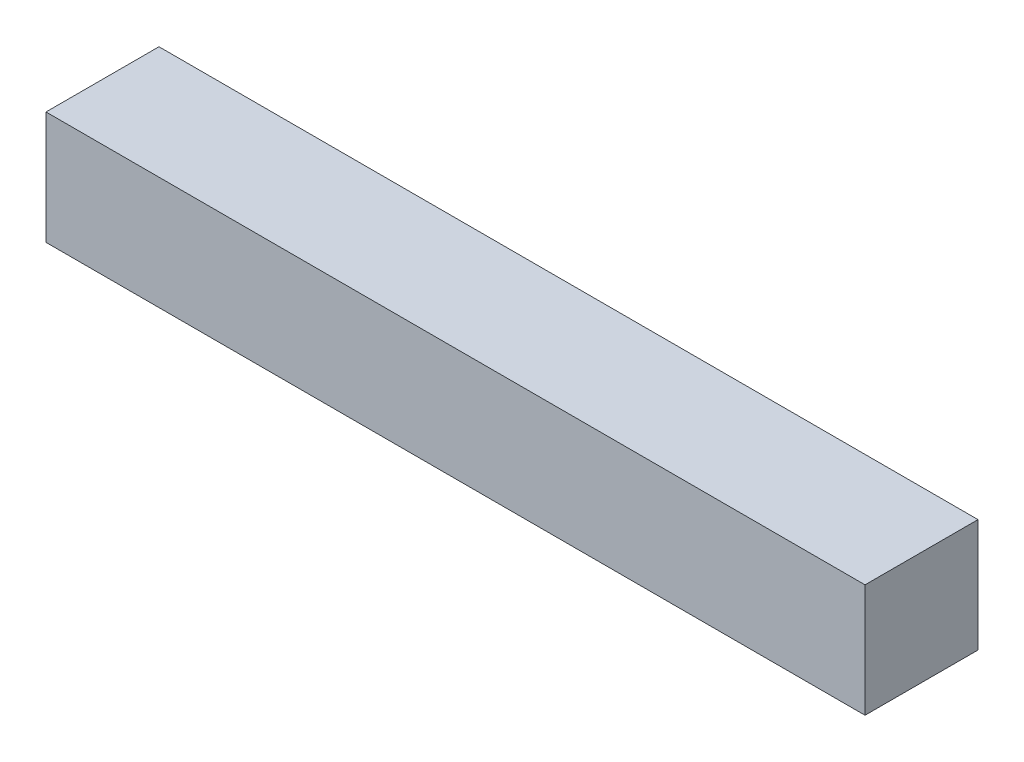
ISO-10303-21;
HEADER;
FILE_DESCRIPTION(('STEP AP214'),'2;1');
FILE_NAME('part.step','',(''),(''),'','','');
FILE_SCHEMA(('AUTOMOTIVE_DESIGN { 1 0 10303 214 1 1 1 1 }'));
ENDSEC;
DATA;
#1=APPLICATION_CONTEXT('core data for automotive mechanical design processes');
#2=APPLICATION_PROTOCOL_DEFINITION('international standard','automotive_design',2000,#1);
#3=PRODUCT_CONTEXT('',#1,'mechanical');
#4=PRODUCT('Part','Part','',(#3));
#5=PRODUCT_RELATED_PRODUCT_CATEGORY('part','',(#4));
#6=PRODUCT_DEFINITION_FORMATION('','',#4);
#7=PRODUCT_DEFINITION_CONTEXT('part definition',#1,'design');
#8=PRODUCT_DEFINITION('design','',#6,#7);
#9=PRODUCT_DEFINITION_SHAPE('','',#8);
#10=(LENGTH_UNIT() NAMED_UNIT(*) SI_UNIT(.MILLI.,.METRE.));
#11=(NAMED_UNIT(*) PLANE_ANGLE_UNIT() SI_UNIT($,.RADIAN.));
#12=(NAMED_UNIT(*) SI_UNIT($,.STERADIAN.) SOLID_ANGLE_UNIT());
#13=UNCERTAINTY_MEASURE_WITH_UNIT(LENGTH_MEASURE(1.E-05),#10,'distance_accuracy_value','');
#14=(GEOMETRIC_REPRESENTATION_CONTEXT(3) GLOBAL_UNCERTAINTY_ASSIGNED_CONTEXT((#13)) GLOBAL_UNIT_ASSIGNED_CONTEXT((#10,
#11,#12)) REPRESENTATION_CONTEXT('',''));
#15=CARTESIAN_POINT('',(0.,0.,0.));
#16=DIRECTION('',(0.,0.,1.));
#17=DIRECTION('',(1.,0.,0.));
#18=AXIS2_PLACEMENT_3D('',#15,#16,#17);
#19=CARTESIAN_POINT('',(0.,0.,2.));
#20=DIRECTION('',(1.,0.,0.));
#21=DIRECTION('',(0.,0.,-1.));
#22=AXIS2_PLACEMENT_3D('',#19,#20,#21);
#23=PLANE('',#22);
#24=DIRECTION('',(0.,-1.,0.));
#25=VECTOR('',#24,1.);
#26=CARTESIAN_POINT('',(0.,0.,0.));
#27=LINE('',#26,#25);
#28=CARTESIAN_POINT('',(0.,2.,0.));
#29=VERTEX_POINT('',#28);
#30=CARTESIAN_POINT('',(0.,0.,0.));
#31=VERTEX_POINT('',#30);
#32=EDGE_CURVE('E96',#29,#31,#27,.T.);
#33=ORIENTED_EDGE('',*,*,#32,.T.);
#34=DIRECTION('',(0.,0.,-1.));
#35=VECTOR('',#34,1.);
#36=CARTESIAN_POINT('',(0.,0.,2.));
#37=LINE('',#36,#35);
#38=CARTESIAN_POINT('',(0.,0.,2.));
#39=VERTEX_POINT('',#38);
#40=EDGE_CURVE('E11',#39,#31,#37,.T.);
#41=ORIENTED_EDGE('',*,*,#40,.F.);
#42=DIRECTION('',(0.,-1.,0.));
#43=VECTOR('',#42,1.);
#44=CARTESIAN_POINT('',(0.,0.,2.));
#45=LINE('',#44,#43);
#46=CARTESIAN_POINT('',(0.,2.,2.));
#47=VERTEX_POINT('',#46);
#48=EDGE_CURVE('E84',#47,#39,#45,.T.);
#49=ORIENTED_EDGE('',*,*,#48,.F.);
#50=DIRECTION('',(0.,0.,-1.));
#51=VECTOR('',#50,1.);
#52=CARTESIAN_POINT('',(0.,2.,2.));
#53=LINE('',#52,#51);
#54=EDGE_CURVE('E92',#47,#29,#53,.T.);
#55=ORIENTED_EDGE('',*,*,#54,.T.);
#56=EDGE_LOOP('',(#33,#41,#49,#55));
#57=FACE_BOUND('',#56,.T.);
#58=ADVANCED_FACE('F33',(#57),#23,.F.);
#59=CARTESIAN_POINT('',(0.,0.,2.));
#60=DIRECTION('',(0.,1.,0.));
#61=DIRECTION('',(0.,0.,1.));
#62=AXIS2_PLACEMENT_3D('',#59,#60,#61);
#63=PLANE('',#62);
#64=DIRECTION('',(1.,0.,0.));
#65=VECTOR('',#64,1.);
#66=CARTESIAN_POINT('',(0.,0.,0.));
#67=LINE('',#66,#65);
#68=CARTESIAN_POINT('',(14.5,0.,0.));
#69=VERTEX_POINT('',#68);
#70=EDGE_CURVE('E88',#31,#69,#67,.T.);
#71=ORIENTED_EDGE('',*,*,#70,.T.);
#72=DIRECTION('',(0.,0.,-1.));
#73=VECTOR('',#72,1.);
#74=CARTESIAN_POINT('',(14.5,0.,2.));
#75=LINE('',#74,#73);
#76=CARTESIAN_POINT('',(14.5,0.,2.));
#77=VERTEX_POINT('',#76);
#78=EDGE_CURVE('E41',#77,#69,#75,.T.);
#79=ORIENTED_EDGE('',*,*,#78,.F.);
#80=DIRECTION('',(1.,0.,0.));
#81=VECTOR('',#80,1.);
#82=CARTESIAN_POINT('',(0.,0.,2.));
#83=LINE('',#82,#81);
#84=EDGE_CURVE('E79',#39,#77,#83,.T.);
#85=ORIENTED_EDGE('',*,*,#84,.F.);
#86=ORIENTED_EDGE('',*,*,#40,.T.);
#87=EDGE_LOOP('',(#71,#79,#85,#86));
#88=FACE_BOUND('',#87,.T.);
#89=ADVANCED_FACE('F87',(#88),#63,.F.);
#90=CARTESIAN_POINT('',(14.5,0.,2.));
#91=DIRECTION('',(-1.,0.,0.));
#92=DIRECTION('',(0.,0.,1.));
#93=AXIS2_PLACEMENT_3D('',#90,#91,#92);
#94=PLANE('',#93);
#95=DIRECTION('',(0.,1.,0.));
#96=VECTOR('',#95,1.);
#97=CARTESIAN_POINT('',(14.5,0.,0.));
#98=LINE('',#97,#96);
#99=CARTESIAN_POINT('',(14.5,2.,0.));
#100=VERTEX_POINT('',#99);
#101=EDGE_CURVE('E66',#69,#100,#98,.T.);
#102=ORIENTED_EDGE('',*,*,#101,.T.);
#103=DIRECTION('',(0.,0.,-1.));
#104=VECTOR('',#103,1.);
#105=CARTESIAN_POINT('',(14.5,2.,2.));
#106=LINE('',#105,#104);
#107=CARTESIAN_POINT('',(14.5,2.,2.));
#108=VERTEX_POINT('',#107);
#109=EDGE_CURVE('E89',#108,#100,#106,.T.);
#110=ORIENTED_EDGE('',*,*,#109,.F.);
#111=DIRECTION('',(0.,1.,0.));
#112=VECTOR('',#111,1.);
#113=CARTESIAN_POINT('',(14.5,0.,2.));
#114=LINE('',#113,#112);
#115=EDGE_CURVE('E82',#77,#108,#114,.T.);
#116=ORIENTED_EDGE('',*,*,#115,.F.);
#117=ORIENTED_EDGE('',*,*,#78,.T.);
#118=EDGE_LOOP('',(#102,#110,#116,#117));
#119=FACE_BOUND('',#118,.T.);
#120=ADVANCED_FACE('F90',(#119),#94,.F.);
#121=CARTESIAN_POINT('',(0.,2.,2.));
#122=DIRECTION('',(0.,-1.,0.));
#123=DIRECTION('',(0.,0.,-1.));
#124=AXIS2_PLACEMENT_3D('',#121,#122,#123);
#125=PLANE('',#124);
#126=DIRECTION('',(-1.,0.,0.));
#127=VECTOR('',#126,1.);
#128=CARTESIAN_POINT('',(0.,2.,0.));
#129=LINE('',#128,#127);
#130=EDGE_CURVE('E72',#100,#29,#129,.T.);
#131=ORIENTED_EDGE('',*,*,#130,.T.);
#132=ORIENTED_EDGE('',*,*,#54,.F.);
#133=DIRECTION('',(-1.,0.,0.));
#134=VECTOR('',#133,1.);
#135=CARTESIAN_POINT('',(0.,2.,2.));
#136=LINE('',#135,#134);
#137=EDGE_CURVE('E49',#108,#47,#136,.T.);
#138=ORIENTED_EDGE('',*,*,#137,.F.);
#139=ORIENTED_EDGE('',*,*,#109,.T.);
#140=EDGE_LOOP('',(#131,#132,#138,#139));
#141=FACE_BOUND('',#140,.T.);
#142=ADVANCED_FACE('F103',(#141),#125,.F.);
#143=CARTESIAN_POINT('',(0.,0.,2.));
#144=DIRECTION('',(0.,0.,-1.));
#145=DIRECTION('',(-1.,0.,0.));
#146=AXIS2_PLACEMENT_3D('',#143,#144,#145);
#147=PLANE('',#146);
#148=ORIENTED_EDGE('',*,*,#48,.T.);
#149=ORIENTED_EDGE('',*,*,#84,.T.);
#150=ORIENTED_EDGE('',*,*,#115,.T.);
#151=ORIENTED_EDGE('',*,*,#137,.T.);
#152=EDGE_LOOP('',(#148,#149,#150,#151));
#153=FACE_BOUND('',#152,.T.);
#154=ADVANCED_FACE('F80',(#153),#147,.F.);
#155=CARTESIAN_POINT('',(0.,0.,0.));
#156=DIRECTION('',(0.,0.,-1.));
#157=DIRECTION('',(-1.,0.,0.));
#158=AXIS2_PLACEMENT_3D('',#155,#156,#157);
#159=PLANE('',#158);
#160=ORIENTED_EDGE('',*,*,#32,.F.);
#161=ORIENTED_EDGE('',*,*,#130,.F.);
#162=ORIENTED_EDGE('',*,*,#101,.F.);
#163=ORIENTED_EDGE('',*,*,#70,.F.);
#164=EDGE_LOOP('',(#160,#161,#162,#163));
#165=FACE_BOUND('',#164,.T.);
#166=ADVANCED_FACE('F106',(#165),#159,.T.);
#167=CLOSED_SHELL('',(#58,#89,#120,#142,#154,#166));
#168=MANIFOLD_SOLID_BREP('B2',#167);
#169=ADVANCED_BREP_SHAPE_REPRESENTATION('',(#18,#168),#14);
#170=SHAPE_DEFINITION_REPRESENTATION(#9,#169);
ENDSEC;
END-ISO-10303-21;
